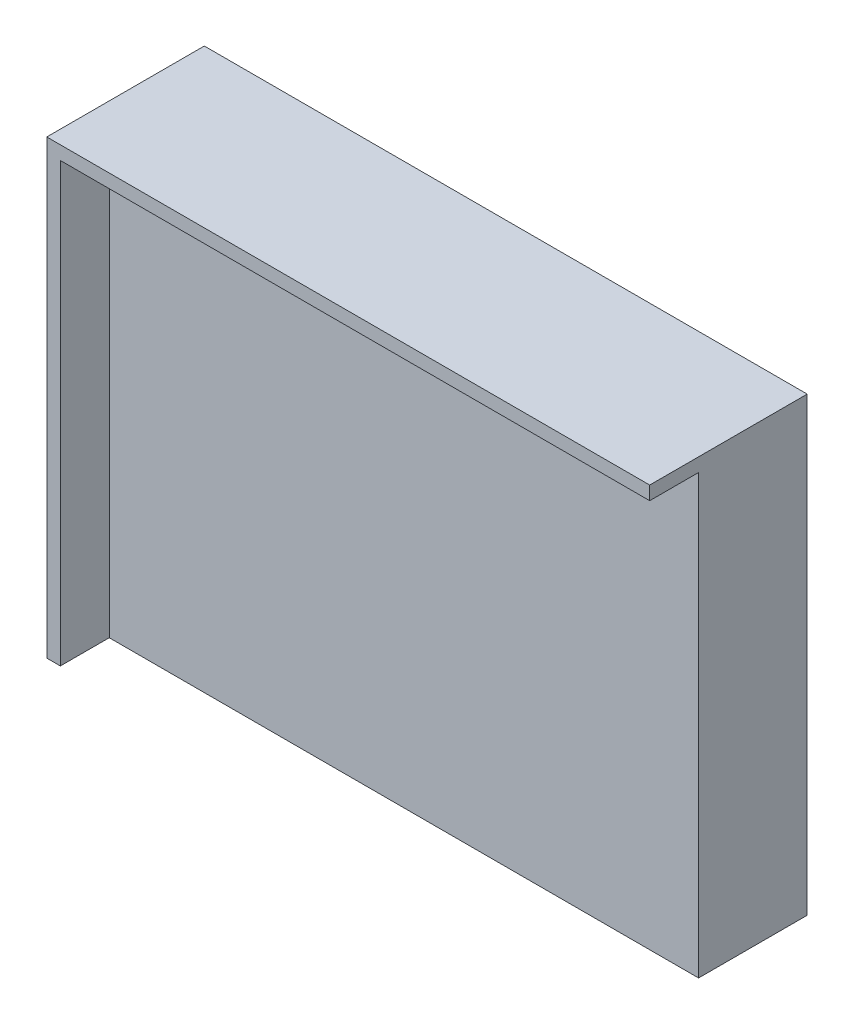
ISO-10303-21;
HEADER;
FILE_DESCRIPTION(('STEP AP214'),'2;1');
FILE_NAME('part.step','',(''),(''),'','','');
FILE_SCHEMA(('AUTOMOTIVE_DESIGN { 1 0 10303 214 1 1 1 1 }'));
ENDSEC;
DATA;
#1=APPLICATION_CONTEXT('core data for automotive mechanical design processes');
#2=APPLICATION_PROTOCOL_DEFINITION('international standard','automotive_design',2000,#1);
#3=PRODUCT_CONTEXT('',#1,'mechanical');
#4=PRODUCT('Part','Part','',(#3));
#5=PRODUCT_RELATED_PRODUCT_CATEGORY('part','',(#4));
#6=PRODUCT_DEFINITION_FORMATION('','',#4);
#7=PRODUCT_DEFINITION_CONTEXT('part definition',#1,'design');
#8=PRODUCT_DEFINITION('design','',#6,#7);
#9=PRODUCT_DEFINITION_SHAPE('','',#8);
#10=(LENGTH_UNIT() NAMED_UNIT(*) SI_UNIT(.MILLI.,.METRE.));
#11=(NAMED_UNIT(*) PLANE_ANGLE_UNIT() SI_UNIT($,.RADIAN.));
#12=(NAMED_UNIT(*) SI_UNIT($,.STERADIAN.) SOLID_ANGLE_UNIT());
#13=UNCERTAINTY_MEASURE_WITH_UNIT(LENGTH_MEASURE(1.E-05),#10,'distance_accuracy_value','');
#14=(GEOMETRIC_REPRESENTATION_CONTEXT(3) GLOBAL_UNCERTAINTY_ASSIGNED_CONTEXT((#13)) GLOBAL_UNIT_ASSIGNED_CONTEXT((#10,
#11,#12)) REPRESENTATION_CONTEXT('',''));
#15=CARTESIAN_POINT('',(0.,0.,0.));
#16=DIRECTION('',(0.,0.,1.));
#17=DIRECTION('',(1.,0.,0.));
#18=AXIS2_PLACEMENT_3D('',#15,#16,#17);
#19=CARTESIAN_POINT('',(72.6168292682927,25.1026341463416,36.83));
#20=DIRECTION('',(0.,1.,0.));
#21=DIRECTION('',(0.,0.,1.));
#22=AXIS2_PLACEMENT_3D('',#19,#20,#21);
#23=PLANE('',#22);
#24=DIRECTION('',(-1.,0.,0.));
#25=VECTOR('',#24,1.);
#26=CARTESIAN_POINT('',(0.,25.1026341463416,25.4));
#27=LINE('',#26,#25);
#28=CARTESIAN_POINT('',(72.6068292682926,25.1026341463416,25.4));
#29=VERTEX_POINT('',#28);
#30=CARTESIAN_POINT('',(-65.1881707317074,25.1026341463416,25.4));
#31=VERTEX_POINT('',#30);
#32=EDGE_CURVE('E146',#29,#31,#27,.T.);
#33=ORIENTED_EDGE('',*,*,#32,.T.);
#34=DIRECTION('',(0.,0.,1.));
#35=VECTOR('',#34,1.);
#36=CARTESIAN_POINT('',(-65.1881707317074,25.1026341463416,0.));
#37=LINE('',#36,#35);
#38=CARTESIAN_POINT('',(-65.1881707317074,25.1026341463416,36.83));
#39=VERTEX_POINT('',#38);
#40=EDGE_CURVE('E11',#31,#39,#37,.T.);
#41=ORIENTED_EDGE('',*,*,#40,.T.);
#42=DIRECTION('',(-1.,0.,0.));
#43=VECTOR('',#42,1.);
#44=CARTESIAN_POINT('',(213.576829268293,25.1026341463416,36.83));
#45=LINE('',#44,#43);
#46=CARTESIAN_POINT('',(-68.3631707317074,25.1026341463416,36.83));
#47=VERTEX_POINT('',#46);
#48=EDGE_CURVE('E46',#39,#47,#45,.T.);
#49=ORIENTED_EDGE('',*,*,#48,.T.);
#50=DIRECTION('',(0.,0.,-1.));
#51=VECTOR('',#50,1.);
#52=CARTESIAN_POINT('',(-68.3631707317073,25.1026341463416,17.272));
#53=LINE('',#52,#51);
#54=CARTESIAN_POINT('',(-68.3631707317074,25.1026341463416,0.));
#55=VERTEX_POINT('',#54);
#56=EDGE_CURVE('E103',#47,#55,#53,.T.);
#57=ORIENTED_EDGE('',*,*,#56,.T.);
#58=DIRECTION('',(-1.,0.,0.));
#59=VECTOR('',#58,1.);
#60=CARTESIAN_POINT('',(0.,25.1026341463416,0.));
#61=LINE('',#60,#59);
#62=CARTESIAN_POINT('',(72.6068292682926,25.1026341463416,0.));
#63=VERTEX_POINT('',#62);
#64=EDGE_CURVE('E136',#63,#55,#61,.T.);
#65=ORIENTED_EDGE('',*,*,#64,.F.);
#66=DIRECTION('',(0.,0.,-1.));
#67=VECTOR('',#66,1.);
#68=CARTESIAN_POINT('',(72.6068292682926,25.1026341463416,36.84));
#69=LINE('',#68,#67);
#70=EDGE_CURVE('E41',#29,#63,#69,.T.);
#71=ORIENTED_EDGE('',*,*,#70,.F.);
#72=EDGE_LOOP('',(#33,#41,#49,#57,#65,#71));
#73=FACE_BOUND('',#72,.T.);
#74=ADVANCED_FACE('F38',(#73),#23,.F.);
#75=CARTESIAN_POINT('',(72.6068292682926,-97.9603658536585,36.84));
#76=DIRECTION('',(-1.,0.,0.));
#77=DIRECTION('',(0.,-1.,0.));
#78=AXIS2_PLACEMENT_3D('',#75,#76,#77);
#79=PLANE('',#78);
#80=DIRECTION('',(0.,-1.,0.));
#81=VECTOR('',#80,1.);
#82=CARTESIAN_POINT('',(72.6068292682926,0.,25.4));
#83=LINE('',#82,#81);
#84=CARTESIAN_POINT('',(72.6068292682926,127.464634146342,25.4));
#85=VERTEX_POINT('',#84);
#86=EDGE_CURVE('E141',#85,#29,#83,.T.);
#87=ORIENTED_EDGE('',*,*,#86,.T.);
#88=ORIENTED_EDGE('',*,*,#70,.T.);
#89=DIRECTION('',(0.,-1.,0.));
#90=VECTOR('',#89,1.);
#91=CARTESIAN_POINT('',(72.6068292682926,0.,0.));
#92=LINE('',#91,#90);
#93=CARTESIAN_POINT('',(72.6068292682926,130.639634146342,0.));
#94=VERTEX_POINT('',#93);
#95=EDGE_CURVE('E113',#94,#63,#92,.T.);
#96=ORIENTED_EDGE('',*,*,#95,.F.);
#97=DIRECTION('',(0.,0.,-1.));
#98=VECTOR('',#97,1.);
#99=CARTESIAN_POINT('',(72.6068292682926,130.639634146342,25.4));
#100=LINE('',#99,#98);
#101=CARTESIAN_POINT('',(72.6068292682926,130.639634146342,36.83));
#102=VERTEX_POINT('',#101);
#103=EDGE_CURVE('E139',#102,#94,#100,.T.);
#104=ORIENTED_EDGE('',*,*,#103,.F.);
#105=DIRECTION('',(0.,-1.,0.));
#106=VECTOR('',#105,1.);
#107=CARTESIAN_POINT('',(72.6068292682926,127.464634146342,36.83));
#108=LINE('',#107,#106);
#109=CARTESIAN_POINT('',(72.6068292682926,127.464634146342,36.83));
#110=VERTEX_POINT('',#109);
#111=EDGE_CURVE('E118',#102,#110,#108,.T.);
#112=ORIENTED_EDGE('',*,*,#111,.T.);
#113=DIRECTION('',(0.,0.,-1.));
#114=VECTOR('',#113,1.);
#115=CARTESIAN_POINT('',(72.6068292682926,127.464634146342,0.));
#116=LINE('',#115,#114);
#117=EDGE_CURVE('E133',#110,#85,#116,.T.);
#118=ORIENTED_EDGE('',*,*,#117,.T.);
#119=EDGE_LOOP('',(#87,#88,#96,#104,#112,#118));
#120=FACE_BOUND('',#119,.T.);
#121=ADVANCED_FACE('F162',(#120),#79,.F.);
#122=CARTESIAN_POINT('',(-68.3631707317073,-94.7853658536585,17.272));
#123=DIRECTION('',(-1.,0.,0.));
#124=DIRECTION('',(0.,0.,1.));
#125=AXIS2_PLACEMENT_3D('',#122,#123,#124);
#126=PLANE('',#125);
#127=ORIENTED_EDGE('',*,*,#56,.F.);
#128=DIRECTION('',(0.,1.,0.));
#129=VECTOR('',#128,1.);
#130=CARTESIAN_POINT('',(-68.3631707317074,130.639634146342,36.83));
#131=LINE('',#130,#129);
#132=CARTESIAN_POINT('',(-68.3631707317074,130.639634146342,36.83));
#133=VERTEX_POINT('',#132);
#134=EDGE_CURVE('E96',#47,#133,#131,.T.);
#135=ORIENTED_EDGE('',*,*,#134,.T.);
#136=DIRECTION('',(0.,0.,-1.));
#137=VECTOR('',#136,1.);
#138=CARTESIAN_POINT('',(-68.3631707317074,130.639634146342,25.4));
#139=LINE('',#138,#137);
#140=CARTESIAN_POINT('',(-68.3631707317074,130.639634146342,0.));
#141=VERTEX_POINT('',#140);
#142=EDGE_CURVE('E100',#133,#141,#139,.T.);
#143=ORIENTED_EDGE('',*,*,#142,.T.);
#144=DIRECTION('',(0.,-1.,0.));
#145=VECTOR('',#144,1.);
#146=CARTESIAN_POINT('',(-68.3631707317074,130.639634146342,0.));
#147=LINE('',#146,#145);
#148=EDGE_CURVE('E130',#141,#55,#147,.T.);
#149=ORIENTED_EDGE('',*,*,#148,.T.);
#150=EDGE_LOOP('',(#127,#135,#143,#149));
#151=FACE_BOUND('',#150,.T.);
#152=ADVANCED_FACE('F98',(#151),#126,.T.);
#153=CARTESIAN_POINT('',(0.,0.,25.4));
#154=DIRECTION('',(0.,0.,1.));
#155=DIRECTION('',(1.,0.,0.));
#156=AXIS2_PLACEMENT_3D('',#153,#154,#155);
#157=PLANE('',#156);
#158=ORIENTED_EDGE('',*,*,#32,.F.);
#159=ORIENTED_EDGE('',*,*,#86,.F.);
#160=DIRECTION('',(-1.,0.,0.));
#161=VECTOR('',#160,1.);
#162=CARTESIAN_POINT('',(-65.1881707317074,127.464634146342,25.4));
#163=LINE('',#162,#161);
#164=CARTESIAN_POINT('',(-65.1881707317074,127.464634146342,25.4));
#165=VERTEX_POINT('',#164);
#166=EDGE_CURVE('E120',#85,#165,#163,.T.);
#167=ORIENTED_EDGE('',*,*,#166,.T.);
#168=DIRECTION('',(0.,-1.,0.));
#169=VECTOR('',#168,1.);
#170=CARTESIAN_POINT('',(-65.1881707317073,-80.4343658536585,25.4));
#171=LINE('',#170,#169);
#172=EDGE_CURVE('E105',#165,#31,#171,.T.);
#173=ORIENTED_EDGE('',*,*,#172,.T.);
#174=EDGE_LOOP('',(#158,#159,#167,#173));
#175=FACE_BOUND('',#174,.T.);
#176=ADVANCED_FACE('F153',(#175),#157,.T.);
#177=CARTESIAN_POINT('',(-68.3631707317074,130.639634146342,25.4));
#178=DIRECTION('',(0.,-1.,0.));
#179=DIRECTION('',(1.,0.,0.));
#180=AXIS2_PLACEMENT_3D('',#177,#178,#179);
#181=PLANE('',#180);
#182=DIRECTION('',(1.,0.,0.));
#183=VECTOR('',#182,1.);
#184=CARTESIAN_POINT('',(213.576829268293,130.639634146342,36.83));
#185=LINE('',#184,#183);
#186=EDGE_CURVE('E110',#133,#102,#185,.T.);
#187=ORIENTED_EDGE('',*,*,#186,.T.);
#188=ORIENTED_EDGE('',*,*,#103,.T.);
#189=DIRECTION('',(-1.,0.,0.));
#190=VECTOR('',#189,1.);
#191=CARTESIAN_POINT('',(-68.3631707317074,130.639634146342,0.));
#192=LINE('',#191,#190);
#193=EDGE_CURVE('E112',#94,#141,#192,.T.);
#194=ORIENTED_EDGE('',*,*,#193,.T.);
#195=ORIENTED_EDGE('',*,*,#142,.F.);
#196=EDGE_LOOP('',(#187,#188,#194,#195));
#197=FACE_BOUND('',#196,.T.);
#198=ADVANCED_FACE('F109',(#197),#181,.F.);
#199=CARTESIAN_POINT('',(0.,0.,0.));
#200=DIRECTION('',(0.,0.,1.));
#201=DIRECTION('',(1.,0.,0.));
#202=AXIS2_PLACEMENT_3D('',#199,#200,#201);
#203=PLANE('',#202);
#204=ORIENTED_EDGE('',*,*,#95,.T.);
#205=ORIENTED_EDGE('',*,*,#64,.T.);
#206=ORIENTED_EDGE('',*,*,#148,.F.);
#207=ORIENTED_EDGE('',*,*,#193,.F.);
#208=EDGE_LOOP('',(#204,#205,#206,#207));
#209=FACE_BOUND('',#208,.T.);
#210=ADVANCED_FACE('F165',(#209),#203,.F.);
#211=CARTESIAN_POINT('',(213.576829268293,127.464634146342,36.83));
#212=DIRECTION('',(0.,0.,1.));
#213=DIRECTION('',(1.,0.,0.));
#214=AXIS2_PLACEMENT_3D('',#211,#212,#213);
#215=PLANE('',#214);
#216=ORIENTED_EDGE('',*,*,#48,.F.);
#217=DIRECTION('',(0.,1.,0.));
#218=VECTOR('',#217,1.);
#219=CARTESIAN_POINT('',(-65.1881707317074,130.639634146342,36.83));
#220=LINE('',#219,#218);
#221=CARTESIAN_POINT('',(-65.1881707317074,127.464634146342,36.83));
#222=VERTEX_POINT('',#221);
#223=EDGE_CURVE('E121',#39,#222,#220,.T.);
#224=ORIENTED_EDGE('',*,*,#223,.T.);
#225=DIRECTION('',(1.,0.,0.));
#226=VECTOR('',#225,1.);
#227=CARTESIAN_POINT('',(213.576829268293,127.464634146342,36.83));
#228=LINE('',#227,#226);
#229=EDGE_CURVE('E128',#222,#110,#228,.T.);
#230=ORIENTED_EDGE('',*,*,#229,.T.);
#231=ORIENTED_EDGE('',*,*,#111,.F.);
#232=ORIENTED_EDGE('',*,*,#186,.F.);
#233=ORIENTED_EDGE('',*,*,#134,.F.);
#234=EDGE_LOOP('',(#216,#224,#230,#231,#232,#233));
#235=FACE_BOUND('',#234,.T.);
#236=ADVANCED_FACE('F115',(#235),#215,.T.);
#237=CARTESIAN_POINT('',(0.,127.464634146342,0.));
#238=DIRECTION('',(0.,-1.,0.));
#239=DIRECTION('',(1.,0.,0.));
#240=AXIS2_PLACEMENT_3D('',#237,#238,#239);
#241=PLANE('',#240);
#242=ORIENTED_EDGE('',*,*,#117,.F.);
#243=ORIENTED_EDGE('',*,*,#229,.F.);
#244=DIRECTION('',(0.,0.,1.));
#245=VECTOR('',#244,1.);
#246=CARTESIAN_POINT('',(-65.1881707317074,127.464634146342,36.83));
#247=LINE('',#246,#245);
#248=EDGE_CURVE('E123',#165,#222,#247,.T.);
#249=ORIENTED_EDGE('',*,*,#248,.F.);
#250=ORIENTED_EDGE('',*,*,#166,.F.);
#251=EDGE_LOOP('',(#242,#243,#249,#250));
#252=FACE_BOUND('',#251,.T.);
#253=ADVANCED_FACE('F160',(#252),#241,.T.);
#254=CARTESIAN_POINT('',(-65.1881707317074,0.,0.));
#255=DIRECTION('',(1.,0.,0.));
#256=DIRECTION('',(0.,1.,0.));
#257=AXIS2_PLACEMENT_3D('',#254,#255,#256);
#258=PLANE('',#257);
#259=ORIENTED_EDGE('',*,*,#40,.F.);
#260=ORIENTED_EDGE('',*,*,#172,.F.);
#261=ORIENTED_EDGE('',*,*,#248,.T.);
#262=ORIENTED_EDGE('',*,*,#223,.F.);
#263=EDGE_LOOP('',(#259,#260,#261,#262));
#264=FACE_BOUND('',#263,.T.);
#265=ADVANCED_FACE('F179',(#264),#258,.T.);
#266=CLOSED_SHELL('',(#74,#121,#152,#176,#198,#210,#236,#253,#265));
#267=MANIFOLD_SOLID_BREP('B2',#266);
#268=ADVANCED_BREP_SHAPE_REPRESENTATION('',(#18,#267),#14);
#269=SHAPE_DEFINITION_REPRESENTATION(#9,#268);
ENDSEC;
END-ISO-10303-21;
